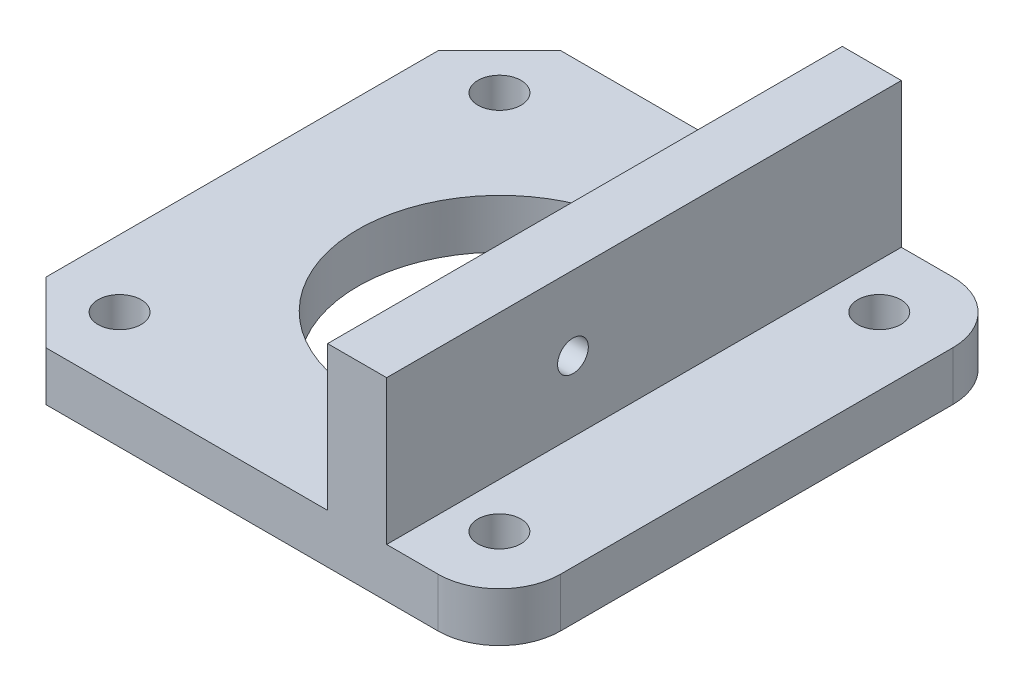
ISO-10303-21;
HEADER;
FILE_DESCRIPTION(('STEP AP214'),'2;1');
FILE_NAME('part.step','',(''),(''),'','','');
FILE_SCHEMA(('AUTOMOTIVE_DESIGN { 1 0 10303 214 1 1 1 1 }'));
ENDSEC;
DATA;
#1=APPLICATION_CONTEXT('core data for automotive mechanical design processes');
#2=APPLICATION_PROTOCOL_DEFINITION('international standard','automotive_design',2000,#1);
#3=PRODUCT_CONTEXT('',#1,'mechanical');
#4=PRODUCT('Part','Part','',(#3));
#5=PRODUCT_RELATED_PRODUCT_CATEGORY('part','',(#4));
#6=PRODUCT_DEFINITION_FORMATION('','',#4);
#7=PRODUCT_DEFINITION_CONTEXT('part definition',#1,'design');
#8=PRODUCT_DEFINITION('design','',#6,#7);
#9=PRODUCT_DEFINITION_SHAPE('','',#8);
#10=(LENGTH_UNIT() NAMED_UNIT(*) SI_UNIT(.MILLI.,.METRE.));
#11=(NAMED_UNIT(*) PLANE_ANGLE_UNIT() SI_UNIT($,.RADIAN.));
#12=(NAMED_UNIT(*) SI_UNIT($,.STERADIAN.) SOLID_ANGLE_UNIT());
#13=UNCERTAINTY_MEASURE_WITH_UNIT(LENGTH_MEASURE(1.E-05),#10,'distance_accuracy_value','');
#14=(GEOMETRIC_REPRESENTATION_CONTEXT(3) GLOBAL_UNCERTAINTY_ASSIGNED_CONTEXT((#13)) GLOBAL_UNIT_ASSIGNED_CONTEXT((#10,
#11,#12)) REPRESENTATION_CONTEXT('',''));
#15=CARTESIAN_POINT('',(0.,0.,0.));
#16=DIRECTION('',(0.,0.,1.));
#17=DIRECTION('',(1.,0.,0.));
#18=AXIS2_PLACEMENT_3D('',#15,#16,#17);
#19=CARTESIAN_POINT('',(0.,4.02,0.));
#20=DIRECTION('',(0.,1.,0.));
#21=DIRECTION('',(0.,0.,1.));
#22=AXIS2_PLACEMENT_3D('',#19,#20,#21);
#23=PLANE('',#22);
#24=CARTESIAN_POINT('',(-15.48,4.02,15.5859002631841));
#25=DIRECTION('',(0.,1.,0.));
#26=DIRECTION('',(0.,0.,1.));
#27=AXIS2_PLACEMENT_3D('',#24,#25,#26);
#28=CIRCLE('',#27,1.76);
#29=CARTESIAN_POINT('',(-15.48,4.02,17.3459002631841));
#30=VERTEX_POINT('',#29);
#31=EDGE_CURVE('E454',#30,#30,#28,.T.);
#32=ORIENTED_EDGE('',*,*,#31,.F.);
#33=EDGE_LOOP('',(#32));
#34=FACE_BOUND('',#33,.T.);
#35=CARTESIAN_POINT('',(-15.48,4.02,-15.42));
#36=DIRECTION('',(0.,1.,0.));
#37=DIRECTION('',(0.,0.,1.));
#38=AXIS2_PLACEMENT_3D('',#35,#36,#37);
#39=CIRCLE('',#38,1.76);
#40=CARTESIAN_POINT('',(-15.48,4.02,-13.66));
#41=VERTEX_POINT('',#40);
#42=EDGE_CURVE('E446',#41,#41,#39,.T.);
#43=ORIENTED_EDGE('',*,*,#42,.F.);
#44=EDGE_LOOP('',(#43));
#45=FACE_BOUND('',#44,.T.);
#46=DIRECTION('',(-1.,0.,0.));
#47=VECTOR('',#46,1.);
#48=CARTESIAN_POINT('',(-20.96,4.02,-20.9));
#49=LINE('',#48,#47);
#50=CARTESIAN_POINT('',(7.02318468499593,4.02,-20.9));
#51=VERTEX_POINT('',#50);
#52=CARTESIAN_POINT('',(-15.96,4.02,-20.9));
#53=VERTEX_POINT('',#52);
#54=EDGE_CURVE('E278',#51,#53,#49,.T.);
#55=ORIENTED_EDGE('',*,*,#54,.T.);
#56=DIRECTION('',(0.707106781186549,0.,-0.707106781186546));
#57=VECTOR('',#56,1.);
#58=CARTESIAN_POINT('',(-18.4299999999999,4.02,-18.43));
#59=LINE('',#58,#57);
#60=CARTESIAN_POINT('',(-20.96,4.02,-15.9));
#61=VERTEX_POINT('',#60);
#62=EDGE_CURVE('E322',#53,#61,#59,.F.);
#63=ORIENTED_EDGE('',*,*,#62,.T.);
#64=DIRECTION('',(0.,0.,1.));
#65=VECTOR('',#64,1.);
#66=CARTESIAN_POINT('',(-20.96,4.02,-20.9));
#67=LINE('',#66,#65);
#68=CARTESIAN_POINT('',(-20.96,4.02,16.11));
#69=VERTEX_POINT('',#68);
#70=EDGE_CURVE('E266',#61,#69,#67,.T.);
#71=ORIENTED_EDGE('',*,*,#70,.T.);
#72=DIRECTION('',(-0.707106781186546,0.,-0.707106781186549));
#73=VECTOR('',#72,1.);
#74=CARTESIAN_POINT('',(-18.535,4.02,18.535));
#75=LINE('',#74,#73);
#76=CARTESIAN_POINT('',(-15.96,4.02,21.11));
#77=VERTEX_POINT('',#76);
#78=EDGE_CURVE('E319',#69,#77,#75,.F.);
#79=ORIENTED_EDGE('',*,*,#78,.T.);
#80=DIRECTION('',(1.,0.,0.));
#81=VECTOR('',#80,1.);
#82=CARTESIAN_POINT('',(-20.96,4.02,21.11));
#83=LINE('',#82,#81);
#84=CARTESIAN_POINT('',(7.02318468499593,4.02,21.11));
#85=VERTEX_POINT('',#84);
#86=EDGE_CURVE('E272',#77,#85,#83,.T.);
#87=ORIENTED_EDGE('',*,*,#86,.T.);
#88=DIRECTION('',(0.,0.,-1.));
#89=VECTOR('',#88,1.);
#90=CARTESIAN_POINT('',(7.02318468499593,4.02,0.));
#91=LINE('',#90,#89);
#92=CARTESIAN_POINT('',(7.02318468499593,4.02,9.23227365714636));
#93=VERTEX_POINT('',#92);
#94=EDGE_CURVE('E241',#85,#93,#91,.T.);
#95=ORIENTED_EDGE('',*,*,#94,.T.);
#96=CARTESIAN_POINT('',(0.,4.02,0.));
#97=DIRECTION('',(0.,1.,0.));
#98=DIRECTION('',(0.,0.,1.));
#99=AXIS2_PLACEMENT_3D('',#96,#97,#98);
#100=CIRCLE('',#99,11.6);
#101=CARTESIAN_POINT('',(2.02335299829288,4.02,-11.4221732890155));
#102=VERTEX_POINT('',#101);
#103=EDGE_CURVE('E245',#102,#93,#100,.T.);
#104=ORIENTED_EDGE('',*,*,#103,.F.);
#105=DIRECTION('',(0.,0.,1.));
#106=VECTOR('',#105,1.);
#107=CARTESIAN_POINT('',(2.02335299829288,4.02,-16.1610866445078));
#108=LINE('',#107,#106);
#109=CARTESIAN_POINT('',(2.02335299829288,4.02,-16.1610866445078));
#110=VERTEX_POINT('',#109);
#111=EDGE_CURVE('E251',#110,#102,#108,.T.);
#112=ORIENTED_EDGE('',*,*,#111,.F.);
#113=DIRECTION('',(-1.,0.,0.));
#114=VECTOR('',#113,1.);
#115=CARTESIAN_POINT('',(4.04,4.02,-16.1610866445078));
#116=LINE('',#115,#114);
#117=CARTESIAN_POINT('',(7.02318468499593,4.02,-16.1610866445078));
#118=VERTEX_POINT('',#117);
#119=EDGE_CURVE('E248',#118,#110,#116,.T.);
#120=ORIENTED_EDGE('',*,*,#119,.F.);
#121=EDGE_CURVE('E230',#118,#51,#91,.T.);
#122=ORIENTED_EDGE('',*,*,#121,.T.);
#123=EDGE_LOOP('',(#55,#63,#71,#79,#87,#95,#104,#112,#120,#122));
#124=FACE_BOUND('',#123,.T.);
#125=ADVANCED_FACE('F44',(#34,#45,#124),#23,.T.);
#126=CARTESIAN_POINT('',(0.,4.02,0.));
#127=DIRECTION('',(0.,-1.,0.));
#128=DIRECTION('',(0.,0.,-1.));
#129=AXIS2_PLACEMENT_3D('',#126,#127,#128);
#130=CYLINDRICAL_SURFACE('',#129,11.6);
#131=ORIENTED_EDGE('',*,*,#103,.T.);
#132=CARTESIAN_POINT('',(0.,4.02,0.));
#133=DIRECTION('',(0.,-1.,0.));
#134=DIRECTION('',(0.,0.,-1.));
#135=AXIS2_PLACEMENT_3D('',#132,#133,#134);
#136=CIRCLE('',#135,11.6);
#137=CARTESIAN_POINT('',(7.02318468499593,4.02,-9.23227365714636));
#138=VERTEX_POINT('',#137);
#139=EDGE_CURVE('E213',#138,#93,#136,.T.);
#140=ORIENTED_EDGE('',*,*,#139,.F.);
#141=DIRECTION('',(0.,-1.,0.));
#142=VECTOR('',#141,1.);
#143=CARTESIAN_POINT('',(7.02318468499593,4.02,-9.23227365714636));
#144=LINE('',#143,#142);
#145=CARTESIAN_POINT('',(7.02318468499593,0.,-9.23227365714636));
#146=VERTEX_POINT('',#145);
#147=EDGE_CURVE('E210',#146,#138,#144,.F.);
#148=ORIENTED_EDGE('',*,*,#147,.F.);
#149=CARTESIAN_POINT('',(0.,0.,0.));
#150=DIRECTION('',(0.,1.,0.));
#151=DIRECTION('',(0.,0.,1.));
#152=AXIS2_PLACEMENT_3D('',#149,#150,#151);
#153=CIRCLE('',#152,11.6);
#154=CARTESIAN_POINT('',(2.02335299829288,0.,-11.4221732890155));
#155=VERTEX_POINT('',#154);
#156=EDGE_CURVE('E193',#155,#146,#153,.T.);
#157=ORIENTED_EDGE('',*,*,#156,.F.);
#158=DIRECTION('',(0.,-1.,0.));
#159=VECTOR('',#158,1.);
#160=CARTESIAN_POINT('',(2.02335299829288,4.02,-11.4221732890155));
#161=LINE('',#160,#159);
#162=EDGE_CURVE('E253',#102,#155,#161,.T.);
#163=ORIENTED_EDGE('',*,*,#162,.F.);
#164=EDGE_LOOP('',(#131,#140,#148,#157,#163));
#165=FACE_BOUND('',#164,.T.);
#166=ADVANCED_FACE('F212',(#165),#130,.F.);
#167=CARTESIAN_POINT('',(2.02335299829288,4.02,-16.1610866445078));
#168=DIRECTION('',(0.,0.,1.));
#169=DIRECTION('',(1.,0.,0.));
#170=AXIS2_PLACEMENT_3D('',#167,#168,#169);
#171=PLANE('',#170);
#172=DIRECTION('',(-1.,0.,0.));
#173=VECTOR('',#172,1.);
#174=CARTESIAN_POINT('',(2.02335299829288,0.,-16.1610866445078));
#175=LINE('',#174,#173);
#176=CARTESIAN_POINT('',(7.02318468499593,0.,-16.1610866445078));
#177=VERTEX_POINT('',#176);
#178=CARTESIAN_POINT('',(2.02335299829288,0.,-16.1610866445078));
#179=VERTEX_POINT('',#178);
#180=EDGE_CURVE('E205',#177,#179,#175,.T.);
#181=ORIENTED_EDGE('',*,*,#180,.F.);
#182=DIRECTION('',(0.,1.,0.));
#183=VECTOR('',#182,1.);
#184=CARTESIAN_POINT('',(7.02318468499593,4.02,-16.1610866445078));
#185=LINE('',#184,#183);
#186=EDGE_CURVE('E222',#177,#118,#185,.T.);
#187=ORIENTED_EDGE('',*,*,#186,.T.);
#188=ORIENTED_EDGE('',*,*,#119,.T.);
#189=DIRECTION('',(0.,-1.,0.));
#190=VECTOR('',#189,1.);
#191=CARTESIAN_POINT('',(2.02335299829288,4.02,-16.1610866445078));
#192=LINE('',#191,#190);
#193=EDGE_CURVE('E261',#110,#179,#192,.T.);
#194=ORIENTED_EDGE('',*,*,#193,.T.);
#195=EDGE_LOOP('',(#181,#187,#188,#194));
#196=FACE_BOUND('',#195,.T.);
#197=ADVANCED_FACE('F378',(#196),#171,.T.);
#198=CARTESIAN_POINT('',(15.52,4.02,-15.42));
#199=DIRECTION('',(0.,1.,0.));
#200=DIRECTION('',(0.,0.,1.));
#201=AXIS2_PLACEMENT_3D('',#198,#199,#200);
#202=CIRCLE('',#201,1.76);
#203=CARTESIAN_POINT('',(15.52,4.02,-13.66));
#204=VERTEX_POINT('',#203);
#205=EDGE_CURVE('E396',#204,#204,#202,.T.);
#206=ORIENTED_EDGE('',*,*,#205,.F.);
#207=EDGE_LOOP('',(#206));
#208=FACE_BOUND('',#207,.T.);
#209=CARTESIAN_POINT('',(15.52,4.02,15.5859002631841));
#210=DIRECTION('',(0.,1.,0.));
#211=DIRECTION('',(0.,0.,1.));
#212=AXIS2_PLACEMENT_3D('',#209,#210,#211);
#213=CIRCLE('',#212,1.76);
#214=CARTESIAN_POINT('',(15.52,4.02,17.3459002631841));
#215=VERTEX_POINT('',#214);
#216=EDGE_CURVE('E399',#215,#215,#213,.T.);
#217=ORIENTED_EDGE('',*,*,#216,.F.);
#218=EDGE_LOOP('',(#217));
#219=FACE_BOUND('',#218,.T.);
#220=CARTESIAN_POINT('',(11.8431846849959,4.02,21.11));
#221=VERTEX_POINT('',#220);
#222=CARTESIAN_POINT('',(16.04,4.02,21.11));
#223=VERTEX_POINT('',#222);
#224=EDGE_CURVE('E270',#221,#223,#83,.T.);
#225=ORIENTED_EDGE('',*,*,#224,.T.);
#226=CARTESIAN_POINT('',(16.04,4.02,16.11));
#227=DIRECTION('',(0.,1.,0.));
#228=DIRECTION('',(0.,0.,1.));
#229=AXIS2_PLACEMENT_3D('',#226,#227,#228);
#230=CIRCLE('',#229,5.);
#231=CARTESIAN_POINT('',(21.04,4.02,16.11));
#232=VERTEX_POINT('',#231);
#233=EDGE_CURVE('E346',#223,#232,#230,.T.);
#234=ORIENTED_EDGE('',*,*,#233,.T.);
#235=DIRECTION('',(0.,0.,-1.));
#236=VECTOR('',#235,1.);
#237=CARTESIAN_POINT('',(21.04,4.02,-20.9));
#238=LINE('',#237,#236);
#239=CARTESIAN_POINT('',(21.04,4.02,-15.9));
#240=VERTEX_POINT('',#239);
#241=EDGE_CURVE('E275',#232,#240,#238,.T.);
#242=ORIENTED_EDGE('',*,*,#241,.T.);
#243=CARTESIAN_POINT('',(16.04,4.02,-15.9));
#244=DIRECTION('',(0.,1.,0.));
#245=DIRECTION('',(0.,0.,1.));
#246=AXIS2_PLACEMENT_3D('',#243,#244,#245);
#247=CIRCLE('',#246,5.);
#248=CARTESIAN_POINT('',(16.04,4.02,-20.9));
#249=VERTEX_POINT('',#248);
#250=EDGE_CURVE('E63',#240,#249,#247,.T.);
#251=ORIENTED_EDGE('',*,*,#250,.T.);
#252=CARTESIAN_POINT('',(11.8431846849959,4.02,-20.9));
#253=VERTEX_POINT('',#252);
#254=EDGE_CURVE('E279',#249,#253,#49,.T.);
#255=ORIENTED_EDGE('',*,*,#254,.T.);
#256=DIRECTION('',(0.,0.,-1.));
#257=VECTOR('',#256,1.);
#258=CARTESIAN_POINT('',(11.8431846849959,4.02,0.));
#259=LINE('',#258,#257);
#260=EDGE_CURVE('E206',#221,#253,#259,.T.);
#261=ORIENTED_EDGE('',*,*,#260,.F.);
#262=EDGE_LOOP('',(#225,#234,#242,#251,#255,#261));
#263=FACE_BOUND('',#262,.T.);
#264=ADVANCED_FACE('F373',(#208,#219,#263),#23,.T.);
#265=CARTESIAN_POINT('',(0.,0.,0.));
#266=DIRECTION('',(0.,1.,0.));
#267=DIRECTION('',(0.,0.,1.));
#268=AXIS2_PLACEMENT_3D('',#265,#266,#267);
#269=PLANE('',#268);
#270=CARTESIAN_POINT('',(15.52,0.,-15.42));
#271=DIRECTION('',(0.,1.,0.));
#272=DIRECTION('',(0.,0.,1.));
#273=AXIS2_PLACEMENT_3D('',#270,#271,#272);
#274=CIRCLE('',#273,1.76);
#275=CARTESIAN_POINT('',(15.52,0.,-13.66));
#276=VERTEX_POINT('',#275);
#277=EDGE_CURVE('E450',#276,#276,#274,.T.);
#278=ORIENTED_EDGE('',*,*,#277,.T.);
#279=EDGE_LOOP('',(#278));
#280=FACE_BOUND('',#279,.T.);
#281=CARTESIAN_POINT('',(-15.48,0.,15.5859002631841));
#282=DIRECTION('',(0.,1.,0.));
#283=DIRECTION('',(0.,0.,1.));
#284=AXIS2_PLACEMENT_3D('',#281,#282,#283);
#285=CIRCLE('',#284,1.76);
#286=CARTESIAN_POINT('',(-15.48,0.,17.3459002631841));
#287=VERTEX_POINT('',#286);
#288=EDGE_CURVE('E458',#287,#287,#285,.T.);
#289=ORIENTED_EDGE('',*,*,#288,.T.);
#290=EDGE_LOOP('',(#289));
#291=FACE_BOUND('',#290,.T.);
#292=CARTESIAN_POINT('',(15.52,0.,15.5859002631841));
#293=DIRECTION('',(0.,1.,0.));
#294=DIRECTION('',(0.,0.,1.));
#295=AXIS2_PLACEMENT_3D('',#292,#293,#294);
#296=CIRCLE('',#295,1.76);
#297=CARTESIAN_POINT('',(15.52,0.,17.3459002631841));
#298=VERTEX_POINT('',#297);
#299=EDGE_CURVE('E459',#298,#298,#296,.T.);
#300=ORIENTED_EDGE('',*,*,#299,.T.);
#301=EDGE_LOOP('',(#300));
#302=FACE_BOUND('',#301,.T.);
#303=CARTESIAN_POINT('',(-15.48,0.,-15.42));
#304=DIRECTION('',(0.,1.,0.));
#305=DIRECTION('',(0.,0.,1.));
#306=AXIS2_PLACEMENT_3D('',#303,#304,#305);
#307=CIRCLE('',#306,1.76);
#308=CARTESIAN_POINT('',(-15.48,0.,-13.66));
#309=VERTEX_POINT('',#308);
#310=EDGE_CURVE('E445',#309,#309,#307,.T.);
#311=ORIENTED_EDGE('',*,*,#310,.T.);
#312=EDGE_LOOP('',(#311));
#313=FACE_BOUND('',#312,.T.);
#314=DIRECTION('',(0.,0.,-1.));
#315=VECTOR('',#314,1.);
#316=CARTESIAN_POINT('',(21.04,0.,-20.9));
#317=LINE('',#316,#315);
#318=CARTESIAN_POINT('',(21.04,0.,16.11));
#319=VERTEX_POINT('',#318);
#320=CARTESIAN_POINT('',(21.04,0.,-15.9));
#321=VERTEX_POINT('',#320);
#322=EDGE_CURVE('E288',#319,#321,#317,.T.);
#323=ORIENTED_EDGE('',*,*,#322,.F.);
#324=CARTESIAN_POINT('',(16.04,0.,16.11));
#325=DIRECTION('',(0.,1.,0.));
#326=DIRECTION('',(0.,0.,1.));
#327=AXIS2_PLACEMENT_3D('',#324,#325,#326);
#328=CIRCLE('',#327,5.);
#329=CARTESIAN_POINT('',(16.04,0.,21.11));
#330=VERTEX_POINT('',#329);
#331=EDGE_CURVE('E339',#319,#330,#328,.F.);
#332=ORIENTED_EDGE('',*,*,#331,.T.);
#333=DIRECTION('',(1.,0.,0.));
#334=VECTOR('',#333,1.);
#335=CARTESIAN_POINT('',(-20.96,0.,21.11));
#336=LINE('',#335,#334);
#337=CARTESIAN_POINT('',(-15.96,0.,21.11));
#338=VERTEX_POINT('',#337);
#339=EDGE_CURVE('E285',#338,#330,#336,.T.);
#340=ORIENTED_EDGE('',*,*,#339,.F.);
#341=DIRECTION('',(0.707106781186546,0.,0.707106781186549));
#342=VECTOR('',#341,1.);
#343=CARTESIAN_POINT('',(-15.96,0.,21.11));
#344=LINE('',#343,#342);
#345=CARTESIAN_POINT('',(-20.96,0.,16.11));
#346=VERTEX_POINT('',#345);
#347=EDGE_CURVE('E309',#338,#346,#344,.F.);
#348=ORIENTED_EDGE('',*,*,#347,.T.);
#349=DIRECTION('',(0.,0.,1.));
#350=VECTOR('',#349,1.);
#351=CARTESIAN_POINT('',(-20.96,0.,-20.9));
#352=LINE('',#351,#350);
#353=CARTESIAN_POINT('',(-20.96,0.,-15.9));
#354=VERTEX_POINT('',#353);
#355=EDGE_CURVE('E265',#354,#346,#352,.T.);
#356=ORIENTED_EDGE('',*,*,#355,.F.);
#357=DIRECTION('',(-0.707106781186549,0.,0.707106781186546));
#358=VECTOR('',#357,1.);
#359=CARTESIAN_POINT('',(-20.96,0.,-15.9));
#360=LINE('',#359,#358);
#361=CARTESIAN_POINT('',(-15.96,0.,-20.9));
#362=VERTEX_POINT('',#361);
#363=EDGE_CURVE('E312',#354,#362,#360,.F.);
#364=ORIENTED_EDGE('',*,*,#363,.T.);
#365=DIRECTION('',(-1.,0.,0.));
#366=VECTOR('',#365,1.);
#367=CARTESIAN_POINT('',(-20.96,0.,-20.9));
#368=LINE('',#367,#366);
#369=CARTESIAN_POINT('',(16.04,0.,-20.9));
#370=VERTEX_POINT('',#369);
#371=EDGE_CURVE('E271',#370,#362,#368,.T.);
#372=ORIENTED_EDGE('',*,*,#371,.F.);
#373=CARTESIAN_POINT('',(16.04,0.,-15.9));
#374=DIRECTION('',(0.,1.,0.));
#375=DIRECTION('',(0.,0.,1.));
#376=AXIS2_PLACEMENT_3D('',#373,#374,#375);
#377=CIRCLE('',#376,5.);
#378=EDGE_CURVE('E336',#370,#321,#377,.F.);
#379=ORIENTED_EDGE('',*,*,#378,.T.);
#380=EDGE_LOOP('',(#323,#332,#340,#348,#356,#364,#372,#379));
#381=FACE_BOUND('',#380,.T.);
#382=ORIENTED_EDGE('',*,*,#156,.T.);
#383=DIRECTION('',(0.,0.,1.));
#384=VECTOR('',#383,1.);
#385=CARTESIAN_POINT('',(7.02318468499593,0.,-20.9));
#386=LINE('',#385,#384);
#387=EDGE_CURVE('E197',#177,#146,#386,.T.);
#388=ORIENTED_EDGE('',*,*,#387,.F.);
#389=ORIENTED_EDGE('',*,*,#180,.T.);
#390=DIRECTION('',(0.,0.,1.));
#391=VECTOR('',#390,1.);
#392=CARTESIAN_POINT('',(2.02335299829288,0.,-16.1610866445078));
#393=LINE('',#392,#391);
#394=EDGE_CURVE('E200',#179,#155,#393,.T.);
#395=ORIENTED_EDGE('',*,*,#394,.T.);
#396=EDGE_LOOP('',(#382,#388,#389,#395));
#397=FACE_BOUND('',#396,.T.);
#398=ADVANCED_FACE('F195',(#280,#291,#302,#313,#381,#397),#269,.F.);
#399=CARTESIAN_POINT('',(-20.96,4.02,-20.9));
#400=DIRECTION('',(1.,0.,0.));
#401=DIRECTION('',(0.,0.,-1.));
#402=AXIS2_PLACEMENT_3D('',#399,#400,#401);
#403=PLANE('',#402);
#404=ORIENTED_EDGE('',*,*,#70,.F.);
#405=DIRECTION('',(0.,-1.,0.));
#406=VECTOR('',#405,1.);
#407=CARTESIAN_POINT('',(-20.96,4.02,-15.9));
#408=LINE('',#407,#406);
#409=EDGE_CURVE('E305',#61,#354,#408,.T.);
#410=ORIENTED_EDGE('',*,*,#409,.T.);
#411=ORIENTED_EDGE('',*,*,#355,.T.);
#412=DIRECTION('',(0.,1.,0.));
#413=VECTOR('',#412,1.);
#414=CARTESIAN_POINT('',(-20.96,4.02,16.11));
#415=LINE('',#414,#413);
#416=EDGE_CURVE('E217',#346,#69,#415,.T.);
#417=ORIENTED_EDGE('',*,*,#416,.T.);
#418=EDGE_LOOP('',(#404,#410,#411,#417));
#419=FACE_BOUND('',#418,.T.);
#420=ADVANCED_FACE('F388',(#419),#403,.F.);
#421=CARTESIAN_POINT('',(-20.96,4.02,21.11));
#422=DIRECTION('',(0.,0.,-1.));
#423=DIRECTION('',(-1.,0.,0.));
#424=AXIS2_PLACEMENT_3D('',#421,#422,#423);
#425=PLANE('',#424);
#426=ORIENTED_EDGE('',*,*,#339,.T.);
#427=DIRECTION('',(0.,-1.,0.));
#428=VECTOR('',#427,1.);
#429=CARTESIAN_POINT('',(16.04,4.02,21.11));
#430=LINE('',#429,#428);
#431=EDGE_CURVE('E74',#330,#223,#430,.F.);
#432=ORIENTED_EDGE('',*,*,#431,.T.);
#433=ORIENTED_EDGE('',*,*,#224,.F.);
#434=DIRECTION('',(0.,1.,0.));
#435=VECTOR('',#434,1.);
#436=CARTESIAN_POINT('',(11.8431846849959,0.,21.11));
#437=LINE('',#436,#435);
#438=CARTESIAN_POINT('',(11.8431846849959,15.81,21.11));
#439=VERTEX_POINT('',#438);
#440=EDGE_CURVE('E424',#221,#439,#437,.T.);
#441=ORIENTED_EDGE('',*,*,#440,.T.);
#442=DIRECTION('',(1.,0.,0.));
#443=VECTOR('',#442,1.);
#444=CARTESIAN_POINT('',(7.02318468499593,15.81,21.11));
#445=LINE('',#444,#443);
#446=CARTESIAN_POINT('',(7.02318468499593,15.81,21.11));
#447=VERTEX_POINT('',#446);
#448=EDGE_CURVE('E430',#447,#439,#445,.T.);
#449=ORIENTED_EDGE('',*,*,#448,.F.);
#450=DIRECTION('',(0.,1.,0.));
#451=VECTOR('',#450,1.);
#452=CARTESIAN_POINT('',(7.02318468499593,0.,21.11));
#453=LINE('',#452,#451);
#454=EDGE_CURVE('E429',#85,#447,#453,.T.);
#455=ORIENTED_EDGE('',*,*,#454,.F.);
#456=ORIENTED_EDGE('',*,*,#86,.F.);
#457=DIRECTION('',(0.,-1.,0.));
#458=VECTOR('',#457,1.);
#459=CARTESIAN_POINT('',(-15.96,4.02,21.11));
#460=LINE('',#459,#458);
#461=EDGE_CURVE('E325',#77,#338,#460,.T.);
#462=ORIENTED_EDGE('',*,*,#461,.T.);
#463=EDGE_LOOP('',(#426,#432,#433,#441,#449,#455,#456,#462));
#464=FACE_BOUND('',#463,.T.);
#465=ADVANCED_FACE('F535',(#464),#425,.F.);
#466=CARTESIAN_POINT('',(21.04,4.02,-20.9));
#467=DIRECTION('',(-1.,0.,0.));
#468=DIRECTION('',(0.,0.,1.));
#469=AXIS2_PLACEMENT_3D('',#466,#467,#468);
#470=PLANE('',#469);
#471=ORIENTED_EDGE('',*,*,#241,.F.);
#472=DIRECTION('',(0.,-1.,0.));
#473=VECTOR('',#472,1.);
#474=CARTESIAN_POINT('',(21.04,4.02,16.11));
#475=LINE('',#474,#473);
#476=EDGE_CURVE('E332',#232,#319,#475,.T.);
#477=ORIENTED_EDGE('',*,*,#476,.T.);
#478=ORIENTED_EDGE('',*,*,#322,.T.);
#479=DIRECTION('',(0.,-1.,0.));
#480=VECTOR('',#479,1.);
#481=CARTESIAN_POINT('',(21.04,4.02,-15.9));
#482=LINE('',#481,#480);
#483=EDGE_CURVE('E329',#321,#240,#482,.F.);
#484=ORIENTED_EDGE('',*,*,#483,.T.);
#485=EDGE_LOOP('',(#471,#477,#478,#484));
#486=FACE_BOUND('',#485,.T.);
#487=ADVANCED_FACE('F409',(#486),#470,.F.);
#488=CARTESIAN_POINT('',(-20.96,4.02,-20.9));
#489=DIRECTION('',(0.,0.,1.));
#490=DIRECTION('',(1.,0.,0.));
#491=AXIS2_PLACEMENT_3D('',#488,#489,#490);
#492=PLANE('',#491);
#493=ORIENTED_EDGE('',*,*,#254,.F.);
#494=DIRECTION('',(0.,-1.,0.));
#495=VECTOR('',#494,1.);
#496=CARTESIAN_POINT('',(16.04,4.02,-20.9));
#497=LINE('',#496,#495);
#498=EDGE_CURVE('E349',#249,#370,#497,.T.);
#499=ORIENTED_EDGE('',*,*,#498,.T.);
#500=ORIENTED_EDGE('',*,*,#371,.T.);
#501=DIRECTION('',(0.,1.,0.));
#502=VECTOR('',#501,1.);
#503=CARTESIAN_POINT('',(-15.96,4.02,-20.9));
#504=LINE('',#503,#502);
#505=EDGE_CURVE('E316',#362,#53,#504,.T.);
#506=ORIENTED_EDGE('',*,*,#505,.T.);
#507=ORIENTED_EDGE('',*,*,#54,.F.);
#508=DIRECTION('',(0.,1.,0.));
#509=VECTOR('',#508,1.);
#510=CARTESIAN_POINT('',(7.02318468499593,0.,-20.9));
#511=LINE('',#510,#509);
#512=CARTESIAN_POINT('',(7.02318468499593,15.81,-20.9));
#513=VERTEX_POINT('',#512);
#514=EDGE_CURVE('E234',#51,#513,#511,.T.);
#515=ORIENTED_EDGE('',*,*,#514,.T.);
#516=DIRECTION('',(1.,0.,0.));
#517=VECTOR('',#516,1.);
#518=CARTESIAN_POINT('',(7.02318468499593,15.81,-20.9));
#519=LINE('',#518,#517);
#520=CARTESIAN_POINT('',(11.8431846849959,15.81,-20.9));
#521=VERTEX_POINT('',#520);
#522=EDGE_CURVE('E434',#513,#521,#519,.T.);
#523=ORIENTED_EDGE('',*,*,#522,.T.);
#524=DIRECTION('',(0.,1.,0.));
#525=VECTOR('',#524,1.);
#526=CARTESIAN_POINT('',(11.8431846849959,0.,-20.9));
#527=LINE('',#526,#525);
#528=EDGE_CURVE('E421',#253,#521,#527,.T.);
#529=ORIENTED_EDGE('',*,*,#528,.F.);
#530=EDGE_LOOP('',(#493,#499,#500,#506,#507,#515,#523,#529));
#531=FACE_BOUND('',#530,.T.);
#532=ADVANCED_FACE('F418',(#531),#492,.F.);
#533=CARTESIAN_POINT('',(2.02335299829288,4.02,-16.1610866445078));
#534=DIRECTION('',(1.,0.,0.));
#535=DIRECTION('',(0.,0.,-1.));
#536=AXIS2_PLACEMENT_3D('',#533,#534,#535);
#537=PLANE('',#536);
#538=ORIENTED_EDGE('',*,*,#394,.F.);
#539=ORIENTED_EDGE('',*,*,#193,.F.);
#540=ORIENTED_EDGE('',*,*,#111,.T.);
#541=ORIENTED_EDGE('',*,*,#162,.T.);
#542=EDGE_LOOP('',(#538,#539,#540,#541));
#543=FACE_BOUND('',#542,.T.);
#544=ADVANCED_FACE('F513',(#543),#537,.T.);
#545=CARTESIAN_POINT('',(7.02318468499593,15.81,-20.9));
#546=DIRECTION('',(0.,-1.,0.));
#547=DIRECTION('',(0.,0.,-1.));
#548=AXIS2_PLACEMENT_3D('',#545,#546,#547);
#549=PLANE('',#548);
#550=ORIENTED_EDGE('',*,*,#448,.T.);
#551=DIRECTION('',(0.,0.,1.));
#552=VECTOR('',#551,1.);
#553=CARTESIAN_POINT('',(11.8431846849959,15.81,-20.9));
#554=LINE('',#553,#552);
#555=EDGE_CURVE('E224',#521,#439,#554,.T.);
#556=ORIENTED_EDGE('',*,*,#555,.F.);
#557=ORIENTED_EDGE('',*,*,#522,.F.);
#558=DIRECTION('',(0.,0.,1.));
#559=VECTOR('',#558,1.);
#560=CARTESIAN_POINT('',(7.02318468499593,15.81,-20.9));
#561=LINE('',#560,#559);
#562=EDGE_CURVE('E225',#513,#447,#561,.T.);
#563=ORIENTED_EDGE('',*,*,#562,.T.);
#564=EDGE_LOOP('',(#550,#556,#557,#563));
#565=FACE_BOUND('',#564,.T.);
#566=ADVANCED_FACE('F509',(#565),#549,.F.);
#567=CARTESIAN_POINT('',(11.8431846849959,0.,-20.9));
#568=DIRECTION('',(1.,0.,0.));
#569=DIRECTION('',(0.,1.,0.));
#570=AXIS2_PLACEMENT_3D('',#567,#568,#569);
#571=PLANE('',#570);
#572=CARTESIAN_POINT('',(11.8431846849959,9.75192169547193,5.905));
#573=DIRECTION('',(1.,0.,0.));
#574=DIRECTION('',(0.,0.,-1.));
#575=AXIS2_PLACEMENT_3D('',#572,#573,#574);
#576=CIRCLE('',#575,1.255);
#577=CARTESIAN_POINT('',(11.8431846849959,9.75192169547193,4.65));
#578=VERTEX_POINT('',#577);
#579=EDGE_CURVE('E302',#578,#578,#576,.T.);
#580=ORIENTED_EDGE('',*,*,#579,.F.);
#581=EDGE_LOOP('',(#580));
#582=FACE_BOUND('',#581,.T.);
#583=ORIENTED_EDGE('',*,*,#440,.F.);
#584=ORIENTED_EDGE('',*,*,#260,.T.);
#585=ORIENTED_EDGE('',*,*,#528,.T.);
#586=ORIENTED_EDGE('',*,*,#555,.T.);
#587=EDGE_LOOP('',(#583,#584,#585,#586));
#588=FACE_BOUND('',#587,.T.);
#589=ADVANCED_FACE('F423',(#582,#588),#571,.T.);
#590=CARTESIAN_POINT('',(7.02318468499593,0.,-20.9));
#591=DIRECTION('',(1.,0.,0.));
#592=DIRECTION('',(0.,1.,0.));
#593=AXIS2_PLACEMENT_3D('',#590,#591,#592);
#594=PLANE('',#593);
#595=CARTESIAN_POINT('',(7.02318468499593,9.48031919810662,-13.936978862341));
#596=DIRECTION('',(1.,0.,0.));
#597=DIRECTION('',(0.,1.,0.));
#598=AXIS2_PLACEMENT_3D('',#595,#596,#597);
#599=CIRCLE('',#598,2.515);
#600=CARTESIAN_POINT('',(7.02318468499593,11.9953191981066,-13.936978862341));
#601=VERTEX_POINT('',#600);
#602=EDGE_CURVE('E353',#601,#601,#599,.F.);
#603=ORIENTED_EDGE('',*,*,#602,.F.);
#604=EDGE_LOOP('',(#603));
#605=FACE_BOUND('',#604,.T.);
#606=CARTESIAN_POINT('',(7.02318468499593,9.75192169547193,5.905));
#607=DIRECTION('',(1.,0.,0.));
#608=DIRECTION('',(0.,1.,0.));
#609=AXIS2_PLACEMENT_3D('',#606,#607,#608);
#610=CIRCLE('',#609,1.255);
#611=CARTESIAN_POINT('',(7.02318468499593,11.0069216954719,5.905));
#612=VERTEX_POINT('',#611);
#613=EDGE_CURVE('E298',#612,#612,#610,.T.);
#614=ORIENTED_EDGE('',*,*,#613,.T.);
#615=EDGE_LOOP('',(#614));
#616=FACE_BOUND('',#615,.T.);
#617=ORIENTED_EDGE('',*,*,#387,.T.);
#618=ORIENTED_EDGE('',*,*,#147,.T.);
#619=DIRECTION('',(0.,0.,-1.));
#620=VECTOR('',#619,1.);
#621=CARTESIAN_POINT('',(7.02318468499593,4.02,-20.9));
#622=LINE('',#621,#620);
#623=EDGE_CURVE('E218',#93,#138,#622,.T.);
#624=ORIENTED_EDGE('',*,*,#623,.F.);
#625=ORIENTED_EDGE('',*,*,#94,.F.);
#626=ORIENTED_EDGE('',*,*,#454,.T.);
#627=ORIENTED_EDGE('',*,*,#562,.F.);
#628=ORIENTED_EDGE('',*,*,#514,.F.);
#629=ORIENTED_EDGE('',*,*,#121,.F.);
#630=ORIENTED_EDGE('',*,*,#186,.F.);
#631=EDGE_LOOP('',(#617,#618,#624,#625,#626,#627,#628,#629,#630));
#632=FACE_BOUND('',#631,.T.);
#633=ADVANCED_FACE('F220',(#605,#616,#632),#594,.F.);
#634=CARTESIAN_POINT('',(0.,4.02,0.));
#635=DIRECTION('',(0.,-1.,0.));
#636=DIRECTION('',(0.,0.,-1.));
#637=AXIS2_PLACEMENT_3D('',#634,#635,#636);
#638=PLANE('',#637);
#639=ORIENTED_EDGE('',*,*,#623,.T.);
#640=ORIENTED_EDGE('',*,*,#139,.T.);
#641=EDGE_LOOP('',(#639,#640));
#642=FACE_BOUND('',#641,.T.);
#643=ADVANCED_FACE('F499',(#642),#638,.T.);
#644=CARTESIAN_POINT('',(-20.96,9.75192169547193,5.905));
#645=DIRECTION('',(1.,0.,0.));
#646=DIRECTION('',(0.,0.,-1.));
#647=AXIS2_PLACEMENT_3D('',#644,#645,#646);
#648=CYLINDRICAL_SURFACE('',#647,1.255);
#649=ORIENTED_EDGE('',*,*,#579,.T.);
#650=EDGE_LOOP('',(#649));
#651=FACE_BOUND('',#650,.T.);
#652=ORIENTED_EDGE('',*,*,#613,.F.);
#653=EDGE_LOOP('',(#652));
#654=FACE_BOUND('',#653,.T.);
#655=ADVANCED_FACE('F495',(#651,#654),#648,.F.);
#656=CARTESIAN_POINT('',(-20.96,4.02,-15.9));
#657=DIRECTION('',(0.707106781186546,0.,0.707106781186549));
#658=DIRECTION('',(0.,-1.,0.));
#659=AXIS2_PLACEMENT_3D('',#656,#657,#658);
#660=PLANE('',#659);
#661=ORIENTED_EDGE('',*,*,#62,.F.);
#662=ORIENTED_EDGE('',*,*,#505,.F.);
#663=ORIENTED_EDGE('',*,*,#363,.F.);
#664=ORIENTED_EDGE('',*,*,#409,.F.);
#665=EDGE_LOOP('',(#661,#662,#663,#664));
#666=FACE_BOUND('',#665,.T.);
#667=ADVANCED_FACE('F498',(#666),#660,.F.);
#668=CARTESIAN_POINT('',(-15.96,4.02,21.11));
#669=DIRECTION('',(0.707106781186549,0.,-0.707106781186546));
#670=DIRECTION('',(0.,-1.,0.));
#671=AXIS2_PLACEMENT_3D('',#668,#669,#670);
#672=PLANE('',#671);
#673=ORIENTED_EDGE('',*,*,#78,.F.);
#674=ORIENTED_EDGE('',*,*,#416,.F.);
#675=ORIENTED_EDGE('',*,*,#347,.F.);
#676=ORIENTED_EDGE('',*,*,#461,.F.);
#677=EDGE_LOOP('',(#673,#674,#675,#676));
#678=FACE_BOUND('',#677,.T.);
#679=ADVANCED_FACE('F487',(#678),#672,.F.);
#680=CARTESIAN_POINT('',(-15.48,0.,-15.42));
#681=DIRECTION('',(0.,1.,0.));
#682=DIRECTION('',(0.,0.,1.));
#683=AXIS2_PLACEMENT_3D('',#680,#681,#682);
#684=CYLINDRICAL_SURFACE('',#683,1.76);
#685=ORIENTED_EDGE('',*,*,#310,.F.);
#686=EDGE_LOOP('',(#685));
#687=FACE_BOUND('',#686,.T.);
#688=ORIENTED_EDGE('',*,*,#42,.T.);
#689=EDGE_LOOP('',(#688));
#690=FACE_BOUND('',#689,.T.);
#691=ADVANCED_FACE('F479',(#687,#690),#684,.F.);
#692=CARTESIAN_POINT('',(15.52,0.,15.5859002631841));
#693=DIRECTION('',(0.,1.,0.));
#694=DIRECTION('',(0.,0.,1.));
#695=AXIS2_PLACEMENT_3D('',#692,#693,#694);
#696=CYLINDRICAL_SURFACE('',#695,1.76);
#697=ORIENTED_EDGE('',*,*,#299,.F.);
#698=EDGE_LOOP('',(#697));
#699=FACE_BOUND('',#698,.T.);
#700=ORIENTED_EDGE('',*,*,#216,.T.);
#701=EDGE_LOOP('',(#700));
#702=FACE_BOUND('',#701,.T.);
#703=ADVANCED_FACE('F476',(#699,#702),#696,.F.);
#704=CARTESIAN_POINT('',(-15.48,0.,15.5859002631841));
#705=DIRECTION('',(0.,1.,0.));
#706=DIRECTION('',(0.,0.,1.));
#707=AXIS2_PLACEMENT_3D('',#704,#705,#706);
#708=CYLINDRICAL_SURFACE('',#707,1.76);
#709=ORIENTED_EDGE('',*,*,#288,.F.);
#710=EDGE_LOOP('',(#709));
#711=FACE_BOUND('',#710,.T.);
#712=ORIENTED_EDGE('',*,*,#31,.T.);
#713=EDGE_LOOP('',(#712));
#714=FACE_BOUND('',#713,.T.);
#715=ADVANCED_FACE('F478',(#711,#714),#708,.F.);
#716=CARTESIAN_POINT('',(15.52,0.,-15.42));
#717=DIRECTION('',(0.,1.,0.));
#718=DIRECTION('',(0.,0.,1.));
#719=AXIS2_PLACEMENT_3D('',#716,#717,#718);
#720=CYLINDRICAL_SURFACE('',#719,1.76);
#721=ORIENTED_EDGE('',*,*,#277,.F.);
#722=EDGE_LOOP('',(#721));
#723=FACE_BOUND('',#722,.T.);
#724=ORIENTED_EDGE('',*,*,#205,.T.);
#725=EDGE_LOOP('',(#724));
#726=FACE_BOUND('',#725,.T.);
#727=ADVANCED_FACE('F484',(#723,#726),#720,.F.);
#728=CARTESIAN_POINT('',(16.04,4.02,16.11));
#729=DIRECTION('',(0.,-1.,0.));
#730=DIRECTION('',(0.,0.,-1.));
#731=AXIS2_PLACEMENT_3D('',#728,#729,#730);
#732=CYLINDRICAL_SURFACE('',#731,5.);
#733=ORIENTED_EDGE('',*,*,#233,.F.);
#734=ORIENTED_EDGE('',*,*,#431,.F.);
#735=ORIENTED_EDGE('',*,*,#331,.F.);
#736=ORIENTED_EDGE('',*,*,#476,.F.);
#737=EDGE_LOOP('',(#733,#734,#735,#736));
#738=FACE_BOUND('',#737,.T.);
#739=ADVANCED_FACE('F406',(#738),#732,.T.);
#740=CARTESIAN_POINT('',(16.04,4.02,-15.9));
#741=DIRECTION('',(0.,-1.,0.));
#742=DIRECTION('',(0.,0.,-1.));
#743=AXIS2_PLACEMENT_3D('',#740,#741,#742);
#744=CYLINDRICAL_SURFACE('',#743,5.);
#745=ORIENTED_EDGE('',*,*,#250,.F.);
#746=ORIENTED_EDGE('',*,*,#483,.F.);
#747=ORIENTED_EDGE('',*,*,#378,.F.);
#748=ORIENTED_EDGE('',*,*,#498,.F.);
#749=EDGE_LOOP('',(#745,#746,#747,#748));
#750=FACE_BOUND('',#749,.T.);
#751=ADVANCED_FACE('F416',(#750),#744,.T.);
#752=CARTESIAN_POINT('',(3.10318468499593,9.48031919810662,-13.936978862341));
#753=DIRECTION('',(1.,0.,0.));
#754=DIRECTION('',(0.,1.,0.));
#755=AXIS2_PLACEMENT_3D('',#752,#753,#754);
#756=CYLINDRICAL_SURFACE('',#755,2.515);
#757=CARTESIAN_POINT('',(3.60318468499593,9.48031919810662,-13.936978862341));
#758=DIRECTION('',(-1.,0.,0.));
#759=DIRECTION('',(0.,-1.,0.));
#760=AXIS2_PLACEMENT_3D('',#757,#758,#759);
#761=CIRCLE('',#760,2.515);
#762=CARTESIAN_POINT('',(3.60318468499593,6.96531919810662,-13.936978862341));
#763=VERTEX_POINT('',#762);
#764=EDGE_CURVE('E11',#763,#763,#761,.F.);
#765=ORIENTED_EDGE('',*,*,#764,.T.);
#766=EDGE_LOOP('',(#765));
#767=FACE_BOUND('',#766,.T.);
#768=ORIENTED_EDGE('',*,*,#602,.T.);
#769=EDGE_LOOP('',(#768));
#770=FACE_BOUND('',#769,.T.);
#771=ADVANCED_FACE('F367',(#767,#770),#756,.T.);
#772=CARTESIAN_POINT('',(3.10318468499593,9.48031919810662,-13.936978862341));
#773=DIRECTION('',(-1.,0.,0.));
#774=DIRECTION('',(0.,-1.,0.));
#775=AXIS2_PLACEMENT_3D('',#772,#773,#774);
#776=PLANE('',#775);
#777=CARTESIAN_POINT('',(3.10318468499593,9.48031919810662,-13.936978862341));
#778=DIRECTION('',(-1.,0.,0.));
#779=DIRECTION('',(0.,-1.,0.));
#780=AXIS2_PLACEMENT_3D('',#777,#778,#779);
#781=CIRCLE('',#780,2.015);
#782=CARTESIAN_POINT('',(3.10318468499593,7.46531919810661,-13.936978862341));
#783=VERTEX_POINT('',#782);
#784=EDGE_CURVE('E53',#783,#783,#781,.T.);
#785=ORIENTED_EDGE('',*,*,#784,.T.);
#786=EDGE_LOOP('',(#785));
#787=FACE_BOUND('',#786,.T.);
#788=ADVANCED_FACE('F360',(#787),#776,.T.);
#789=CARTESIAN_POINT('',(3.60318468499593,9.48031919810662,-13.936978862341));
#790=DIRECTION('',(-1.,0.,0.));
#791=DIRECTION('',(0.,-1.,0.));
#792=AXIS2_PLACEMENT_3D('',#789,#790,#791);
#793=TOROIDAL_SURFACE('',#792,2.015,0.5);
#794=ORIENTED_EDGE('',*,*,#764,.F.);
#795=EDGE_LOOP('',(#794));
#796=FACE_BOUND('',#795,.T.);
#797=ORIENTED_EDGE('',*,*,#784,.F.);
#798=EDGE_LOOP('',(#797));
#799=FACE_BOUND('',#798,.T.);
#800=ADVANCED_FACE('F46',(#796,#799),#793,.T.);
#801=CLOSED_SHELL('',(#125,#166,#197,#264,#398,#420,#465,#487,#532,#544,#566,#589,#633,#643,
#655,#667,#679,#691,#703,#715,#727,#739,#751,#771,#788,#800));
#802=MANIFOLD_SOLID_BREP('B2',#801);
#803=ADVANCED_BREP_SHAPE_REPRESENTATION('',(#18,#802),#14);
#804=SHAPE_DEFINITION_REPRESENTATION(#9,#803);
ENDSEC;
END-ISO-10303-21;
